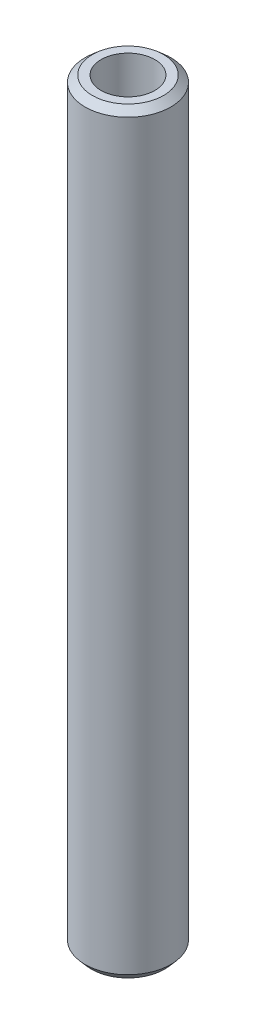
ISO-10303-21;
HEADER;
FILE_DESCRIPTION(('STEP AP214'),'2;1');
FILE_NAME('part.step','',(''),(''),'','','');
FILE_SCHEMA(('AUTOMOTIVE_DESIGN { 1 0 10303 214 1 1 1 1 }'));
ENDSEC;
DATA;
#1=APPLICATION_CONTEXT('core data for automotive mechanical design processes');
#2=APPLICATION_PROTOCOL_DEFINITION('international standard','automotive_design',2000,#1);
#3=PRODUCT_CONTEXT('',#1,'mechanical');
#4=PRODUCT('Part','Part','',(#3));
#5=PRODUCT_RELATED_PRODUCT_CATEGORY('part','',(#4));
#6=PRODUCT_DEFINITION_FORMATION('','',#4);
#7=PRODUCT_DEFINITION_CONTEXT('part definition',#1,'design');
#8=PRODUCT_DEFINITION('design','',#6,#7);
#9=PRODUCT_DEFINITION_SHAPE('','',#8);
#10=(LENGTH_UNIT() NAMED_UNIT(*) SI_UNIT(.MILLI.,.METRE.));
#11=(NAMED_UNIT(*) PLANE_ANGLE_UNIT() SI_UNIT($,.RADIAN.));
#12=(NAMED_UNIT(*) SI_UNIT($,.STERADIAN.) SOLID_ANGLE_UNIT());
#13=UNCERTAINTY_MEASURE_WITH_UNIT(LENGTH_MEASURE(1.E-05),#10,'distance_accuracy_value','');
#14=(GEOMETRIC_REPRESENTATION_CONTEXT(3) GLOBAL_UNCERTAINTY_ASSIGNED_CONTEXT((#13)) GLOBAL_UNIT_ASSIGNED_CONTEXT((#10,
#11,#12)) REPRESENTATION_CONTEXT('',''));
#15=CARTESIAN_POINT('',(0.,0.,0.));
#16=DIRECTION('',(0.,0.,1.));
#17=DIRECTION('',(1.,0.,0.));
#18=AXIS2_PLACEMENT_3D('',#15,#16,#17);
#19=CARTESIAN_POINT('',(0.,308.865107020181,0.));
#20=DIRECTION('',(0.,-1.,0.));
#21=DIRECTION('',(0.,0.,-1.));
#22=AXIS2_PLACEMENT_3D('',#19,#20,#21);
#23=CYLINDRICAL_SURFACE('',#22,17.5);
#24=CARTESIAN_POINT('',(0.,306.289086399353,0.));
#25=DIRECTION('',(0.,1.,0.));
#26=DIRECTION('',(0.,0.,1.));
#27=AXIS2_PLACEMENT_3D('',#24,#25,#26);
#28=CIRCLE('',#27,17.5);
#29=CARTESIAN_POINT('',(0.,306.289086399353,17.5));
#30=VERTEX_POINT('',#29);
#31=EDGE_CURVE('E50',#30,#30,#28,.F.);
#32=ORIENTED_EDGE('',*,*,#31,.T.);
#33=EDGE_LOOP('',(#32));
#34=FACE_BOUND('',#33,.T.);
#35=CARTESIAN_POINT('',(0.,2.97992363387051,0.));
#36=DIRECTION('',(0.,1.,0.));
#37=DIRECTION('',(0.,0.,1.));
#38=AXIS2_PLACEMENT_3D('',#35,#36,#37);
#39=CIRCLE('',#38,17.5);
#40=CARTESIAN_POINT('',(0.,2.97992363387051,17.5));
#41=VERTEX_POINT('',#40);
#42=EDGE_CURVE('E51',#41,#41,#39,.T.);
#43=ORIENTED_EDGE('',*,*,#42,.T.);
#44=EDGE_LOOP('',(#43));
#45=FACE_BOUND('',#44,.T.);
#46=ADVANCED_FACE('F39',(#34,#45),#23,.T.);
#47=CARTESIAN_POINT('',(0.,308.865107020181,0.));
#48=DIRECTION('',(0.,1.,0.));
#49=DIRECTION('',(0.,0.,1.));
#50=AXIS2_PLACEMENT_3D('',#47,#48,#49);
#51=PLANE('',#50);
#52=CARTESIAN_POINT('',(0.,308.865107020181,0.));
#53=DIRECTION('',(0.,1.,0.));
#54=DIRECTION('',(0.,0.,1.));
#55=AXIS2_PLACEMENT_3D('',#52,#53,#54);
#56=CIRCLE('',#55,14.5200763661294);
#57=CARTESIAN_POINT('',(0.,308.865107020181,14.5200763661294));
#58=VERTEX_POINT('',#57);
#59=EDGE_CURVE('E54',#58,#58,#56,.T.);
#60=ORIENTED_EDGE('',*,*,#59,.T.);
#61=EDGE_LOOP('',(#60));
#62=FACE_BOUND('',#61,.T.);
#63=CARTESIAN_POINT('',(0.,308.865107020181,0.));
#64=DIRECTION('',(0.,1.,0.));
#65=DIRECTION('',(0.,0.,1.));
#66=AXIS2_PLACEMENT_3D('',#63,#64,#65);
#67=CIRCLE('',#66,10.9665873629631);
#68=CARTESIAN_POINT('',(0.,308.865107020181,10.9665873629631));
#69=VERTEX_POINT('',#68);
#70=EDGE_CURVE('E58',#69,#69,#67,.T.);
#71=ORIENTED_EDGE('',*,*,#70,.F.);
#72=EDGE_LOOP('',(#71));
#73=FACE_BOUND('',#72,.T.);
#74=ADVANCED_FACE('F69',(#62,#73),#51,.T.);
#75=CARTESIAN_POINT('',(0.,0.,0.));
#76=DIRECTION('',(0.,1.,0.));
#77=DIRECTION('',(0.,0.,1.));
#78=AXIS2_PLACEMENT_3D('',#75,#76,#77);
#79=PLANE('',#78);
#80=CARTESIAN_POINT('',(0.,0.,0.));
#81=DIRECTION('',(0.,1.,0.));
#82=DIRECTION('',(0.,0.,1.));
#83=AXIS2_PLACEMENT_3D('',#80,#81,#82);
#84=CIRCLE('',#83,14.9239793791729);
#85=CARTESIAN_POINT('',(0.,0.,14.9239793791729));
#86=VERTEX_POINT('',#85);
#87=EDGE_CURVE('E10',#86,#86,#84,.F.);
#88=ORIENTED_EDGE('',*,*,#87,.T.);
#89=EDGE_LOOP('',(#88));
#90=FACE_BOUND('',#89,.T.);
#91=CARTESIAN_POINT('',(0.,0.,0.));
#92=DIRECTION('',(0.,1.,0.));
#93=DIRECTION('',(0.,0.,1.));
#94=AXIS2_PLACEMENT_3D('',#91,#92,#93);
#95=CIRCLE('',#94,10.9665873629631);
#96=CARTESIAN_POINT('',(0.,0.,10.9665873629631));
#97=VERTEX_POINT('',#96);
#98=EDGE_CURVE('E63',#97,#97,#95,.T.);
#99=ORIENTED_EDGE('',*,*,#98,.T.);
#100=EDGE_LOOP('',(#99));
#101=FACE_BOUND('',#100,.T.);
#102=ADVANCED_FACE('F75',(#90,#101),#79,.F.);
#103=CARTESIAN_POINT('',(0.,308.865107020181,0.));
#104=DIRECTION('',(0.,-1.,0.));
#105=DIRECTION('',(0.,0.,-1.));
#106=AXIS2_PLACEMENT_3D('',#103,#104,#105);
#107=CYLINDRICAL_SURFACE('',#106,10.9665873629631);
#108=ORIENTED_EDGE('',*,*,#70,.T.);
#109=EDGE_LOOP('',(#108));
#110=FACE_BOUND('',#109,.T.);
#111=ORIENTED_EDGE('',*,*,#98,.F.);
#112=EDGE_LOOP('',(#111));
#113=FACE_BOUND('',#112,.T.);
#114=ADVANCED_FACE('F70',(#110,#113),#107,.F.);
#115=CARTESIAN_POINT('',(0.,308.865107020181,0.));
#116=DIRECTION('',(0.,-1.,0.));
#117=DIRECTION('',(0.,0.,-1.));
#118=AXIS2_PLACEMENT_3D('',#115,#116,#117);
#119=CONICAL_SURFACE('',#118,14.5200763661294,0.857967957224022);
#120=ORIENTED_EDGE('',*,*,#31,.F.);
#121=EDGE_LOOP('',(#120));
#122=FACE_BOUND('',#121,.T.);
#123=ORIENTED_EDGE('',*,*,#59,.F.);
#124=EDGE_LOOP('',(#123));
#125=FACE_BOUND('',#124,.T.);
#126=ADVANCED_FACE('F81',(#122,#125),#119,.T.);
#127=CARTESIAN_POINT('',(0.,2.97992363387051,0.));
#128=DIRECTION('',(0.,1.,0.));
#129=DIRECTION('',(0.,0.,1.));
#130=AXIS2_PLACEMENT_3D('',#127,#128,#129);
#131=CONICAL_SURFACE('',#130,17.5,0.712828369570879);
#132=ORIENTED_EDGE('',*,*,#87,.F.);
#133=EDGE_LOOP('',(#132));
#134=FACE_BOUND('',#133,.T.);
#135=ORIENTED_EDGE('',*,*,#42,.F.);
#136=EDGE_LOOP('',(#135));
#137=FACE_BOUND('',#136,.T.);
#138=ADVANCED_FACE('F45',(#134,#137),#131,.T.);
#139=CLOSED_SHELL('',(#46,#74,#102,#114,#126,#138));
#140=MANIFOLD_SOLID_BREP('B2',#139);
#141=ADVANCED_BREP_SHAPE_REPRESENTATION('',(#18,#140),#14);
#142=SHAPE_DEFINITION_REPRESENTATION(#9,#141);
ENDSEC;
END-ISO-10303-21;
